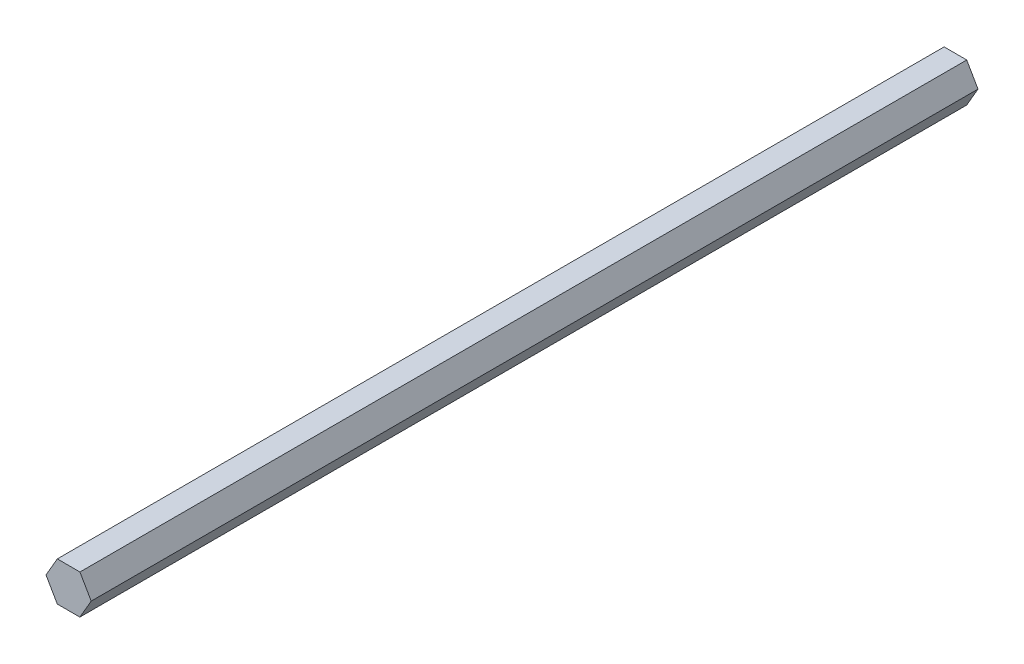
ISO-10303-21;
HEADER;
FILE_DESCRIPTION(('STEP AP214'),'2;1');
FILE_NAME('part.step','',(''),(''),'','','');
FILE_SCHEMA(('AUTOMOTIVE_DESIGN { 1 0 10303 214 1 1 1 1 }'));
ENDSEC;
DATA;
#1=APPLICATION_CONTEXT('core data for automotive mechanical design processes');
#2=APPLICATION_PROTOCOL_DEFINITION('international standard','automotive_design',2000,#1);
#3=PRODUCT_CONTEXT('',#1,'mechanical');
#4=PRODUCT('Part','Part','',(#3));
#5=PRODUCT_RELATED_PRODUCT_CATEGORY('part','',(#4));
#6=PRODUCT_DEFINITION_FORMATION('','',#4);
#7=PRODUCT_DEFINITION_CONTEXT('part definition',#1,'design');
#8=PRODUCT_DEFINITION('design','',#6,#7);
#9=PRODUCT_DEFINITION_SHAPE('','',#8);
#10=(LENGTH_UNIT() NAMED_UNIT(*) SI_UNIT(.MILLI.,.METRE.));
#11=(NAMED_UNIT(*) PLANE_ANGLE_UNIT() SI_UNIT($,.RADIAN.));
#12=(NAMED_UNIT(*) SI_UNIT($,.STERADIAN.) SOLID_ANGLE_UNIT());
#13=UNCERTAINTY_MEASURE_WITH_UNIT(LENGTH_MEASURE(1.E-05),#10,'distance_accuracy_value','');
#14=(GEOMETRIC_REPRESENTATION_CONTEXT(3) GLOBAL_UNCERTAINTY_ASSIGNED_CONTEXT((#13)) GLOBAL_UNIT_ASSIGNED_CONTEXT((#10,
#11,#12)) REPRESENTATION_CONTEXT('',''));
#15=CARTESIAN_POINT('',(0.,0.,0.));
#16=DIRECTION('',(0.,0.,1.));
#17=DIRECTION('',(1.,0.,0.));
#18=AXIS2_PLACEMENT_3D('',#15,#16,#17);
#19=CARTESIAN_POINT('',(1.53288639169219,-0.00332599833008655,60.1599));
#20=DIRECTION('',(-0.867108243569953,-0.498119758625405,0.));
#21=DIRECTION('',(0.498119758625405,-0.867108243569953,0.));
#22=AXIS2_PLACEMENT_3D('',#19,#20,#21);
#23=PLANE('',#22);
#24=DIRECTION('',(-0.498119758625405,0.867108243569953,0.));
#25=VECTOR('',#24,1.);
#26=CARTESIAN_POINT('',(1.53288639169219,-0.00332599833008655,0.));
#27=LINE('',#26,#25);
#28=CARTESIAN_POINT('',(1.53288639169219,-0.00332599833008655,0.));
#29=VERTEX_POINT('',#28);
#30=CARTESIAN_POINT('',(0.769323594892895,1.32585555715586,0.));
#31=VERTEX_POINT('',#30);
#32=EDGE_CURVE('E116',#29,#31,#27,.T.);
#33=ORIENTED_EDGE('',*,*,#32,.T.);
#34=DIRECTION('',(0.,0.,-1.));
#35=VECTOR('',#34,1.);
#36=CARTESIAN_POINT('',(0.769323594892895,1.32585555715586,60.1599));
#37=LINE('',#36,#35);
#38=CARTESIAN_POINT('',(0.769323594892895,1.32585555715586,60.1599));
#39=VERTEX_POINT('',#38);
#40=EDGE_CURVE('E11',#39,#31,#37,.T.);
#41=ORIENTED_EDGE('',*,*,#40,.F.);
#42=DIRECTION('',(-0.498119758625405,0.867108243569953,0.));
#43=VECTOR('',#42,1.);
#44=CARTESIAN_POINT('',(1.53288639169219,-0.00332599833008655,60.1599));
#45=LINE('',#44,#43);
#46=CARTESIAN_POINT('',(1.53288639169219,-0.00332599833008655,60.1599));
#47=VERTEX_POINT('',#46);
#48=EDGE_CURVE('E126',#47,#39,#45,.T.);
#49=ORIENTED_EDGE('',*,*,#48,.F.);
#50=DIRECTION('',(0.,0.,-1.));
#51=VECTOR('',#50,1.);
#52=CARTESIAN_POINT('',(1.53288639169219,-0.00332599833008655,60.1599));
#53=LINE('',#52,#51);
#54=EDGE_CURVE('E112',#47,#29,#53,.T.);
#55=ORIENTED_EDGE('',*,*,#54,.T.);
#56=EDGE_LOOP('',(#33,#41,#49,#55));
#57=FACE_BOUND('',#56,.T.);
#58=ADVANCED_FACE('F32',(#57),#23,.F.);
#59=CARTESIAN_POINT('',(0.769323594892895,1.32585555715586,60.1599));
#60=DIRECTION('',(-0.00216975668840331,-0.999997646075186,0.));
#61=DIRECTION('',(0.999997646075186,-0.00216975668840331,0.));
#62=AXIS2_PLACEMENT_3D('',#59,#60,#61);
#63=PLANE('',#62);
#64=DIRECTION('',(-0.999997646075186,0.00216975668840331,0.));
#65=VECTOR('',#64,1.);
#66=CARTESIAN_POINT('',(0.769323594892895,1.32585555715586,0.));
#67=LINE('',#66,#65);
#68=CARTESIAN_POINT('',(-0.763562796799296,1.32918155548594,0.));
#69=VERTEX_POINT('',#68);
#70=EDGE_CURVE('E119',#31,#69,#67,.T.);
#71=ORIENTED_EDGE('',*,*,#70,.T.);
#72=DIRECTION('',(0.,0.,-1.));
#73=VECTOR('',#72,1.);
#74=CARTESIAN_POINT('',(-0.763562796799296,1.32918155548594,60.1599));
#75=LINE('',#74,#73);
#76=CARTESIAN_POINT('',(-0.763562796799296,1.32918155548594,60.1599));
#77=VERTEX_POINT('',#76);
#78=EDGE_CURVE('E40',#77,#69,#75,.T.);
#79=ORIENTED_EDGE('',*,*,#78,.F.);
#80=DIRECTION('',(-0.999997646075186,0.00216975668840331,0.));
#81=VECTOR('',#80,1.);
#82=CARTESIAN_POINT('',(0.769323594892895,1.32585555715586,60.1599));
#83=LINE('',#82,#81);
#84=EDGE_CURVE('E85',#39,#77,#83,.T.);
#85=ORIENTED_EDGE('',*,*,#84,.F.);
#86=ORIENTED_EDGE('',*,*,#40,.T.);
#87=EDGE_LOOP('',(#71,#79,#85,#86));
#88=FACE_BOUND('',#87,.T.);
#89=ADVANCED_FACE('F150',(#88),#63,.F.);
#90=CARTESIAN_POINT('',(-0.763562796799296,1.32918155548594,60.1599));
#91=DIRECTION('',(0.86493848688155,-0.501877887449781,0.));
#92=DIRECTION('',(0.501877887449781,0.86493848688155,0.));
#93=AXIS2_PLACEMENT_3D('',#90,#91,#92);
#94=PLANE('',#93);
#95=DIRECTION('',(-0.501877887449781,-0.86493848688155,0.));
#96=VECTOR('',#95,1.);
#97=CARTESIAN_POINT('',(-0.763562796799296,1.32918155548594,0.));
#98=LINE('',#97,#96);
#99=CARTESIAN_POINT('',(-1.53288639169219,0.00332599833008634,0.));
#100=VERTEX_POINT('',#99);
#101=EDGE_CURVE('E121',#69,#100,#98,.T.);
#102=ORIENTED_EDGE('',*,*,#101,.T.);
#103=DIRECTION('',(0.,0.,-1.));
#104=VECTOR('',#103,1.);
#105=CARTESIAN_POINT('',(-1.53288639169219,0.00332599833008634,60.1599));
#106=LINE('',#105,#104);
#107=CARTESIAN_POINT('',(-1.53288639169219,0.00332599833008634,60.1599));
#108=VERTEX_POINT('',#107);
#109=EDGE_CURVE('E107',#108,#100,#106,.T.);
#110=ORIENTED_EDGE('',*,*,#109,.F.);
#111=DIRECTION('',(-0.501877887449781,-0.86493848688155,0.));
#112=VECTOR('',#111,1.);
#113=CARTESIAN_POINT('',(-0.763562796799296,1.32918155548594,60.1599));
#114=LINE('',#113,#112);
#115=EDGE_CURVE('E98',#77,#108,#114,.T.);
#116=ORIENTED_EDGE('',*,*,#115,.F.);
#117=ORIENTED_EDGE('',*,*,#78,.T.);
#118=EDGE_LOOP('',(#102,#110,#116,#117));
#119=FACE_BOUND('',#118,.T.);
#120=ADVANCED_FACE('F132',(#119),#94,.F.);
#121=CARTESIAN_POINT('',(-1.53288639169219,0.00332599833008634,60.1599));
#122=DIRECTION('',(0.867108243569953,0.498119758625405,0.));
#123=DIRECTION('',(-0.498119758625405,0.867108243569953,0.));
#124=AXIS2_PLACEMENT_3D('',#121,#122,#123);
#125=PLANE('',#124);
#126=DIRECTION('',(0.498119758625405,-0.867108243569953,0.));
#127=VECTOR('',#126,1.);
#128=CARTESIAN_POINT('',(-1.53288639169219,0.00332599833008634,0.));
#129=LINE('',#128,#127);
#130=CARTESIAN_POINT('',(-0.769323594892895,-1.32585555715586,0.));
#131=VERTEX_POINT('',#130);
#132=EDGE_CURVE('E106',#100,#131,#129,.T.);
#133=ORIENTED_EDGE('',*,*,#132,.T.);
#134=DIRECTION('',(0.,0.,-1.));
#135=VECTOR('',#134,1.);
#136=CARTESIAN_POINT('',(-0.769323594892895,-1.32585555715586,60.1599));
#137=LINE('',#136,#135);
#138=CARTESIAN_POINT('',(-0.769323594892895,-1.32585555715586,60.1599));
#139=VERTEX_POINT('',#138);
#140=EDGE_CURVE('E103',#139,#131,#137,.T.);
#141=ORIENTED_EDGE('',*,*,#140,.F.);
#142=DIRECTION('',(0.498119758625405,-0.867108243569953,0.));
#143=VECTOR('',#142,1.);
#144=CARTESIAN_POINT('',(-1.53288639169219,0.00332599833008634,60.1599));
#145=LINE('',#144,#143);
#146=EDGE_CURVE('E92',#108,#139,#145,.T.);
#147=ORIENTED_EDGE('',*,*,#146,.F.);
#148=ORIENTED_EDGE('',*,*,#109,.T.);
#149=EDGE_LOOP('',(#133,#141,#147,#148));
#150=FACE_BOUND('',#149,.T.);
#151=ADVANCED_FACE('F104',(#150),#125,.F.);
#152=CARTESIAN_POINT('',(-0.769323594892895,-1.32585555715586,60.1599));
#153=DIRECTION('',(0.00216975668840317,0.999997646075186,0.));
#154=DIRECTION('',(-0.999997646075186,0.00216975668840317,0.));
#155=AXIS2_PLACEMENT_3D('',#152,#153,#154);
#156=PLANE('',#155);
#157=DIRECTION('',(0.999997646075186,-0.00216975668840317,0.));
#158=VECTOR('',#157,1.);
#159=CARTESIAN_POINT('',(-0.769323594892895,-1.32585555715586,0.));
#160=LINE('',#159,#158);
#161=CARTESIAN_POINT('',(0.763562796799296,-1.32918155548594,0.));
#162=VERTEX_POINT('',#161);
#163=EDGE_CURVE('E71',#131,#162,#160,.T.);
#164=ORIENTED_EDGE('',*,*,#163,.T.);
#165=DIRECTION('',(0.,0.,-1.));
#166=VECTOR('',#165,1.);
#167=CARTESIAN_POINT('',(0.763562796799296,-1.32918155548594,60.1599));
#168=LINE('',#167,#166);
#169=CARTESIAN_POINT('',(0.763562796799296,-1.32918155548594,60.1599));
#170=VERTEX_POINT('',#169);
#171=EDGE_CURVE('E108',#170,#162,#168,.T.);
#172=ORIENTED_EDGE('',*,*,#171,.F.);
#173=DIRECTION('',(0.999997646075186,-0.00216975668840317,0.));
#174=VECTOR('',#173,1.);
#175=CARTESIAN_POINT('',(-0.769323594892895,-1.32585555715586,60.1599));
#176=LINE('',#175,#174);
#177=EDGE_CURVE('E96',#139,#170,#176,.T.);
#178=ORIENTED_EDGE('',*,*,#177,.F.);
#179=ORIENTED_EDGE('',*,*,#140,.T.);
#180=EDGE_LOOP('',(#164,#172,#178,#179));
#181=FACE_BOUND('',#180,.T.);
#182=ADVANCED_FACE('F110',(#181),#156,.F.);
#183=CARTESIAN_POINT('',(0.763562796799296,-1.32918155548594,60.1599));
#184=DIRECTION('',(-0.86493848688155,0.501877887449782,0.));
#185=DIRECTION('',(-0.501877887449782,-0.86493848688155,0.));
#186=AXIS2_PLACEMENT_3D('',#183,#184,#185);
#187=PLANE('',#186);
#188=DIRECTION('',(0.501877887449781,0.864938486881549,0.));
#189=VECTOR('',#188,1.);
#190=CARTESIAN_POINT('',(0.763562796799296,-1.32918155548594,0.));
#191=LINE('',#190,#189);
#192=EDGE_CURVE('E77',#162,#29,#191,.T.);
#193=ORIENTED_EDGE('',*,*,#192,.T.);
#194=ORIENTED_EDGE('',*,*,#54,.F.);
#195=DIRECTION('',(0.501877887449781,0.864938486881549,0.));
#196=VECTOR('',#195,1.);
#197=CARTESIAN_POINT('',(0.763562796799296,-1.32918155548594,60.1599));
#198=LINE('',#197,#196);
#199=EDGE_CURVE('E48',#170,#47,#198,.T.);
#200=ORIENTED_EDGE('',*,*,#199,.F.);
#201=ORIENTED_EDGE('',*,*,#171,.T.);
#202=EDGE_LOOP('',(#193,#194,#200,#201));
#203=FACE_BOUND('',#202,.T.);
#204=ADVANCED_FACE('F139',(#203),#187,.F.);
#205=CARTESIAN_POINT('',(0.,0.,60.1599));
#206=DIRECTION('',(0.,0.,1.));
#207=DIRECTION('',(1.,0.,0.));
#208=AXIS2_PLACEMENT_3D('',#205,#206,#207);
#209=PLANE('',#208);
#210=ORIENTED_EDGE('',*,*,#48,.T.);
#211=ORIENTED_EDGE('',*,*,#84,.T.);
#212=ORIENTED_EDGE('',*,*,#115,.T.);
#213=ORIENTED_EDGE('',*,*,#146,.T.);
#214=ORIENTED_EDGE('',*,*,#177,.T.);
#215=ORIENTED_EDGE('',*,*,#199,.T.);
#216=EDGE_LOOP('',(#210,#211,#212,#213,#214,#215));
#217=FACE_BOUND('',#216,.T.);
#218=ADVANCED_FACE('F94',(#217),#209,.T.);
#219=CARTESIAN_POINT('',(0.,0.,0.));
#220=DIRECTION('',(0.,0.,1.));
#221=DIRECTION('',(1.,0.,0.));
#222=AXIS2_PLACEMENT_3D('',#219,#220,#221);
#223=PLANE('',#222);
#224=ORIENTED_EDGE('',*,*,#32,.F.);
#225=ORIENTED_EDGE('',*,*,#192,.F.);
#226=ORIENTED_EDGE('',*,*,#163,.F.);
#227=ORIENTED_EDGE('',*,*,#132,.F.);
#228=ORIENTED_EDGE('',*,*,#101,.F.);
#229=ORIENTED_EDGE('',*,*,#70,.F.);
#230=EDGE_LOOP('',(#224,#225,#226,#227,#228,#229));
#231=FACE_BOUND('',#230,.T.);
#232=ADVANCED_FACE('F135',(#231),#223,.F.);
#233=CLOSED_SHELL('',(#58,#89,#120,#151,#182,#204,#218,#232));
#234=MANIFOLD_SOLID_BREP('B2',#233);
#235=ADVANCED_BREP_SHAPE_REPRESENTATION('',(#18,#234),#14);
#236=SHAPE_DEFINITION_REPRESENTATION(#9,#235);
ENDSEC;
END-ISO-10303-21;
